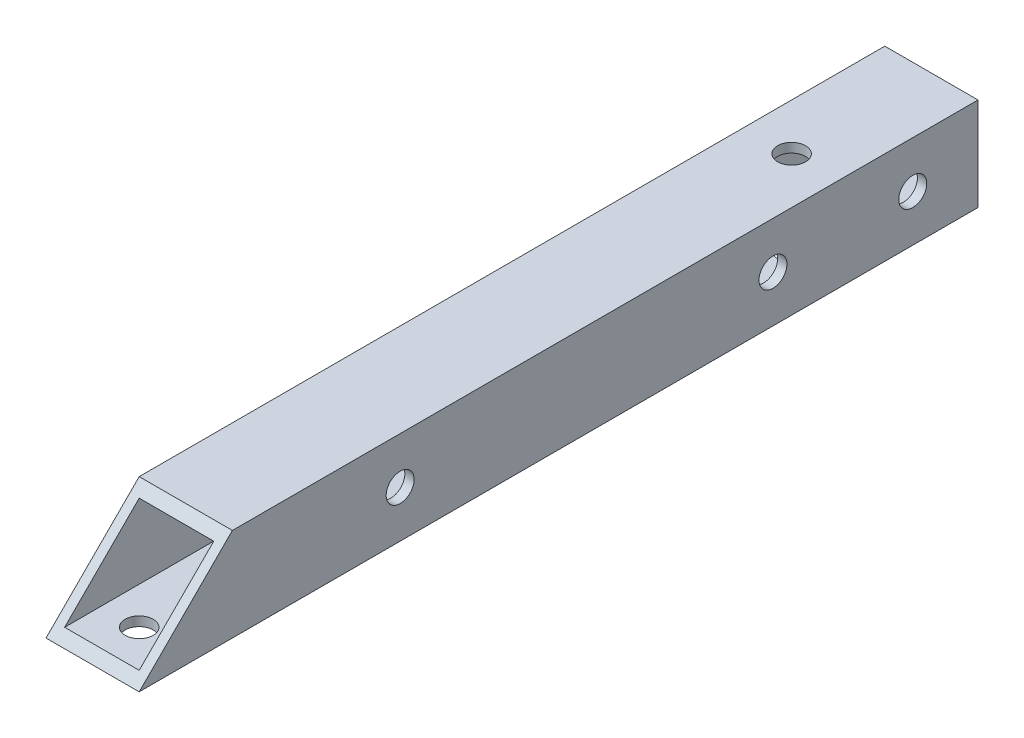
ISO-10303-21;
HEADER;
FILE_DESCRIPTION(('STEP AP214'),'2;1');
FILE_NAME('part.step','',(''),(''),'','','');
FILE_SCHEMA(('AUTOMOTIVE_DESIGN { 1 0 10303 214 1 1 1 1 }'));
ENDSEC;
DATA;
#1=APPLICATION_CONTEXT('core data for automotive mechanical design processes');
#2=APPLICATION_PROTOCOL_DEFINITION('international standard','automotive_design',2000,#1);
#3=PRODUCT_CONTEXT('',#1,'mechanical');
#4=PRODUCT('Part','Part','',(#3));
#5=PRODUCT_RELATED_PRODUCT_CATEGORY('part','',(#4));
#6=PRODUCT_DEFINITION_FORMATION('','',#4);
#7=PRODUCT_DEFINITION_CONTEXT('part definition',#1,'design');
#8=PRODUCT_DEFINITION('design','',#6,#7);
#9=PRODUCT_DEFINITION_SHAPE('','',#8);
#10=(LENGTH_UNIT() NAMED_UNIT(*) SI_UNIT(.MILLI.,.METRE.));
#11=(NAMED_UNIT(*) PLANE_ANGLE_UNIT() SI_UNIT($,.RADIAN.));
#12=(NAMED_UNIT(*) SI_UNIT($,.STERADIAN.) SOLID_ANGLE_UNIT());
#13=UNCERTAINTY_MEASURE_WITH_UNIT(LENGTH_MEASURE(1.E-05),#10,'distance_accuracy_value','');
#14=(GEOMETRIC_REPRESENTATION_CONTEXT(3) GLOBAL_UNCERTAINTY_ASSIGNED_CONTEXT((#13)) GLOBAL_UNIT_ASSIGNED_CONTEXT((#10,
#11,#12)) REPRESENTATION_CONTEXT('',''));
#15=CARTESIAN_POINT('',(0.,0.,0.));
#16=DIRECTION('',(0.,0.,1.));
#17=DIRECTION('',(1.,0.,0.));
#18=AXIS2_PLACEMENT_3D('',#15,#16,#17);
#19=CARTESIAN_POINT('',(0.,0.,0.));
#20=DIRECTION('',(0.,0.,1.));
#21=DIRECTION('',(1.,0.,0.));
#22=AXIS2_PLACEMENT_3D('',#19,#20,#21);
#23=PLANE('',#22);
#24=DIRECTION('',(0.,-1.,0.));
#25=VECTOR('',#24,1.);
#26=CARTESIAN_POINT('',(-5.,5.,0.));
#27=LINE('',#26,#25);
#28=CARTESIAN_POINT('',(-5.,5.,0.));
#29=VERTEX_POINT('',#28);
#30=CARTESIAN_POINT('',(-5.,-5.,0.));
#31=VERTEX_POINT('',#30);
#32=EDGE_CURVE('E231',#29,#31,#27,.T.);
#33=ORIENTED_EDGE('',*,*,#32,.F.);
#34=DIRECTION('',(-1.,0.,0.));
#35=VECTOR('',#34,1.);
#36=CARTESIAN_POINT('',(-5.,5.,0.));
#37=LINE('',#36,#35);
#38=CARTESIAN_POINT('',(4.99999999999999,5.,0.));
#39=VERTEX_POINT('',#38);
#40=EDGE_CURVE('E134',#39,#29,#37,.T.);
#41=ORIENTED_EDGE('',*,*,#40,.F.);
#42=DIRECTION('',(0.,1.,0.));
#43=VECTOR('',#42,1.);
#44=CARTESIAN_POINT('',(4.99999999999999,5.,0.));
#45=LINE('',#44,#43);
#46=CARTESIAN_POINT('',(4.99999999999999,-5.,0.));
#47=VERTEX_POINT('',#46);
#48=EDGE_CURVE('E236',#47,#39,#45,.T.);
#49=ORIENTED_EDGE('',*,*,#48,.F.);
#50=DIRECTION('',(1.,0.,0.));
#51=VECTOR('',#50,1.);
#52=CARTESIAN_POINT('',(-5.,-5.,0.));
#53=LINE('',#52,#51);
#54=EDGE_CURVE('E147',#31,#47,#53,.T.);
#55=ORIENTED_EDGE('',*,*,#54,.F.);
#56=EDGE_LOOP('',(#33,#41,#49,#55));
#57=FACE_BOUND('',#56,.T.);
#58=DIRECTION('',(0.,-1.,0.));
#59=VECTOR('',#58,1.);
#60=CARTESIAN_POINT('',(-4.,5.,0.));
#61=LINE('',#60,#59);
#62=CARTESIAN_POINT('',(-4.,4.,0.));
#63=VERTEX_POINT('',#62);
#64=CARTESIAN_POINT('',(-4.,-4.,0.));
#65=VERTEX_POINT('',#64);
#66=EDGE_CURVE('E212',#63,#65,#61,.T.);
#67=ORIENTED_EDGE('',*,*,#66,.T.);
#68=DIRECTION('',(1.,0.,0.));
#69=VECTOR('',#68,1.);
#70=CARTESIAN_POINT('',(-5.,-4.,0.));
#71=LINE('',#70,#69);
#72=CARTESIAN_POINT('',(3.99999999999999,-4.,0.));
#73=VERTEX_POINT('',#72);
#74=EDGE_CURVE('E215',#65,#73,#71,.T.);
#75=ORIENTED_EDGE('',*,*,#74,.T.);
#76=DIRECTION('',(0.,1.,0.));
#77=VECTOR('',#76,1.);
#78=CARTESIAN_POINT('',(3.99999999999999,5.,0.));
#79=LINE('',#78,#77);
#80=CARTESIAN_POINT('',(3.99999999999999,4.,0.));
#81=VERTEX_POINT('',#80);
#82=EDGE_CURVE('E218',#73,#81,#79,.T.);
#83=ORIENTED_EDGE('',*,*,#82,.T.);
#84=DIRECTION('',(-1.,0.,0.));
#85=VECTOR('',#84,1.);
#86=CARTESIAN_POINT('',(-5.,4.,0.));
#87=LINE('',#86,#85);
#88=EDGE_CURVE('E221',#81,#63,#87,.T.);
#89=ORIENTED_EDGE('',*,*,#88,.T.);
#90=EDGE_LOOP('',(#67,#75,#83,#89));
#91=FACE_BOUND('',#90,.T.);
#92=ADVANCED_FACE('F63',(#57,#91),#23,.F.);
#93=CARTESIAN_POINT('',(-5.,5.,90.));
#94=DIRECTION('',(1.,0.,0.));
#95=DIRECTION('',(0.,0.,-1.));
#96=AXIS2_PLACEMENT_3D('',#93,#94,#95);
#97=PLANE('',#96);
#98=CARTESIAN_POINT('',(-5.,0.,62.));
#99=DIRECTION('',(1.,0.,0.));
#100=DIRECTION('',(0.,0.,-1.));
#101=AXIS2_PLACEMENT_3D('',#98,#99,#100);
#102=CIRCLE('',#101,1.5);
#103=CARTESIAN_POINT('',(-5.,0.,60.5));
#104=VERTEX_POINT('',#103);
#105=EDGE_CURVE('E157',#104,#104,#102,.T.);
#106=ORIENTED_EDGE('',*,*,#105,.T.);
#107=EDGE_LOOP('',(#106));
#108=FACE_BOUND('',#107,.T.);
#109=CARTESIAN_POINT('',(-5.,0.,7.));
#110=DIRECTION('',(1.,0.,0.));
#111=DIRECTION('',(0.,0.,-1.));
#112=AXIS2_PLACEMENT_3D('',#109,#110,#111);
#113=CIRCLE('',#112,1.5);
#114=CARTESIAN_POINT('',(-5.,0.,5.5));
#115=VERTEX_POINT('',#114);
#116=EDGE_CURVE('E198',#115,#115,#113,.T.);
#117=ORIENTED_EDGE('',*,*,#116,.T.);
#118=EDGE_LOOP('',(#117));
#119=FACE_BOUND('',#118,.T.);
#120=CARTESIAN_POINT('',(-5.,0.,22.));
#121=DIRECTION('',(1.,0.,0.));
#122=DIRECTION('',(0.,0.,-1.));
#123=AXIS2_PLACEMENT_3D('',#120,#121,#122);
#124=CIRCLE('',#123,1.5);
#125=CARTESIAN_POINT('',(-5.,0.,20.5));
#126=VERTEX_POINT('',#125);
#127=EDGE_CURVE('E189',#126,#126,#124,.T.);
#128=ORIENTED_EDGE('',*,*,#127,.T.);
#129=EDGE_LOOP('',(#128));
#130=FACE_BOUND('',#129,.T.);
#131=DIRECTION('',(0.,0.,-1.));
#132=VECTOR('',#131,1.);
#133=CARTESIAN_POINT('',(-5.,-5.,90.));
#134=LINE('',#133,#132);
#135=CARTESIAN_POINT('',(-5.,-5.,90.));
#136=VERTEX_POINT('',#135);
#137=EDGE_CURVE('E71',#136,#31,#134,.T.);
#138=ORIENTED_EDGE('',*,*,#137,.F.);
#139=DIRECTION('',(0.,-0.707106781186551,0.707106781186544));
#140=VECTOR('',#139,1.);
#141=CARTESIAN_POINT('',(-5.,-5.,90.));
#142=LINE('',#141,#140);
#143=CARTESIAN_POINT('',(-5.,5.,80.0000000000001));
#144=VERTEX_POINT('',#143);
#145=EDGE_CURVE('E128',#144,#136,#142,.T.);
#146=ORIENTED_EDGE('',*,*,#145,.F.);
#147=DIRECTION('',(0.,0.,-1.));
#148=VECTOR('',#147,1.);
#149=CARTESIAN_POINT('',(-5.,5.,90.));
#150=LINE('',#149,#148);
#151=EDGE_CURVE('E133',#144,#29,#150,.T.);
#152=ORIENTED_EDGE('',*,*,#151,.T.);
#153=ORIENTED_EDGE('',*,*,#32,.T.);
#154=EDGE_LOOP('',(#138,#146,#152,#153));
#155=FACE_BOUND('',#154,.T.);
#156=ADVANCED_FACE('F65',(#108,#119,#130,#155),#97,.F.);
#157=CARTESIAN_POINT('',(-5.,-5.,90.));
#158=DIRECTION('',(0.,1.,0.));
#159=DIRECTION('',(0.,0.,1.));
#160=AXIS2_PLACEMENT_3D('',#157,#158,#159);
#161=PLANE('',#160);
#162=CARTESIAN_POINT('',(0.,-5.,85.));
#163=DIRECTION('',(0.,1.,0.));
#164=DIRECTION('',(0.,0.,1.));
#165=AXIS2_PLACEMENT_3D('',#162,#163,#164);
#166=CIRCLE('',#165,1.5);
#167=CARTESIAN_POINT('',(0.,-5.,86.5));
#168=VERTEX_POINT('',#167);
#169=EDGE_CURVE('E168',#168,#168,#166,.T.);
#170=ORIENTED_EDGE('',*,*,#169,.T.);
#171=EDGE_LOOP('',(#170));
#172=FACE_BOUND('',#171,.T.);
#173=CARTESIAN_POINT('',(0.,-5.,15.));
#174=DIRECTION('',(0.,1.,0.));
#175=DIRECTION('',(0.,0.,1.));
#176=AXIS2_PLACEMENT_3D('',#173,#174,#175);
#177=CIRCLE('',#176,1.5);
#178=CARTESIAN_POINT('',(0.,-5.,16.5));
#179=VERTEX_POINT('',#178);
#180=EDGE_CURVE('E180',#179,#179,#177,.T.);
#181=ORIENTED_EDGE('',*,*,#180,.T.);
#182=EDGE_LOOP('',(#181));
#183=FACE_BOUND('',#182,.T.);
#184=ORIENTED_EDGE('',*,*,#54,.T.);
#185=DIRECTION('',(0.,0.,-1.));
#186=VECTOR('',#185,1.);
#187=CARTESIAN_POINT('',(4.99999999999999,-5.,90.));
#188=LINE('',#187,#186);
#189=CARTESIAN_POINT('',(5.,-5.,90.));
#190=VERTEX_POINT('',#189);
#191=EDGE_CURVE('E141',#190,#47,#188,.T.);
#192=ORIENTED_EDGE('',*,*,#191,.F.);
#193=DIRECTION('',(1.,0.,0.));
#194=VECTOR('',#193,1.);
#195=CARTESIAN_POINT('',(-5.,-5.,90.));
#196=LINE('',#195,#194);
#197=EDGE_CURVE('E125',#136,#190,#196,.T.);
#198=ORIENTED_EDGE('',*,*,#197,.F.);
#199=ORIENTED_EDGE('',*,*,#137,.T.);
#200=EDGE_LOOP('',(#184,#192,#198,#199));
#201=FACE_BOUND('',#200,.T.);
#202=ADVANCED_FACE('F146',(#172,#183,#201),#161,.F.);
#203=CARTESIAN_POINT('',(4.99999999999999,5.,90.));
#204=DIRECTION('',(-1.,0.,0.));
#205=DIRECTION('',(0.,0.,1.));
#206=AXIS2_PLACEMENT_3D('',#203,#204,#205);
#207=PLANE('',#206);
#208=CARTESIAN_POINT('',(4.99999999999999,0.,62.));
#209=DIRECTION('',(1.,0.,0.));
#210=DIRECTION('',(0.,0.,-1.));
#211=AXIS2_PLACEMENT_3D('',#208,#209,#210);
#212=CIRCLE('',#211,1.5);
#213=CARTESIAN_POINT('',(4.99999999999999,0.,60.5));
#214=VERTEX_POINT('',#213);
#215=EDGE_CURVE('E192',#214,#214,#212,.T.);
#216=ORIENTED_EDGE('',*,*,#215,.F.);
#217=EDGE_LOOP('',(#216));
#218=FACE_BOUND('',#217,.T.);
#219=CARTESIAN_POINT('',(4.99999999999999,0.,7.));
#220=DIRECTION('',(1.,0.,0.));
#221=DIRECTION('',(0.,0.,-1.));
#222=AXIS2_PLACEMENT_3D('',#219,#220,#221);
#223=CIRCLE('',#222,1.5);
#224=CARTESIAN_POINT('',(4.99999999999999,0.,5.5));
#225=VERTEX_POINT('',#224);
#226=EDGE_CURVE('E195',#225,#225,#223,.T.);
#227=ORIENTED_EDGE('',*,*,#226,.F.);
#228=EDGE_LOOP('',(#227));
#229=FACE_BOUND('',#228,.T.);
#230=CARTESIAN_POINT('',(4.99999999999999,0.,22.));
#231=DIRECTION('',(1.,0.,0.));
#232=DIRECTION('',(0.,0.,-1.));
#233=AXIS2_PLACEMENT_3D('',#230,#231,#232);
#234=CIRCLE('',#233,1.5);
#235=CARTESIAN_POINT('',(4.99999999999999,0.,20.5));
#236=VERTEX_POINT('',#235);
#237=EDGE_CURVE('E201',#236,#236,#234,.T.);
#238=ORIENTED_EDGE('',*,*,#237,.F.);
#239=EDGE_LOOP('',(#238));
#240=FACE_BOUND('',#239,.T.);
#241=DIRECTION('',(0.,0.,-1.));
#242=VECTOR('',#241,1.);
#243=CARTESIAN_POINT('',(4.99999999999999,5.,90.));
#244=LINE('',#243,#242);
#245=CARTESIAN_POINT('',(4.99999999999999,5.,80.0000000000001));
#246=VERTEX_POINT('',#245);
#247=EDGE_CURVE('E143',#246,#39,#244,.T.);
#248=ORIENTED_EDGE('',*,*,#247,.F.);
#249=DIRECTION('',(0.,-0.707106781186551,0.707106781186544));
#250=VECTOR('',#249,1.);
#251=CARTESIAN_POINT('',(5.,-5.,90.));
#252=LINE('',#251,#250);
#253=EDGE_CURVE('E78',#246,#190,#252,.T.);
#254=ORIENTED_EDGE('',*,*,#253,.T.);
#255=ORIENTED_EDGE('',*,*,#191,.T.);
#256=ORIENTED_EDGE('',*,*,#48,.T.);
#257=EDGE_LOOP('',(#248,#254,#255,#256));
#258=FACE_BOUND('',#257,.T.);
#259=ADVANCED_FACE('F139',(#218,#229,#240,#258),#207,.F.);
#260=CARTESIAN_POINT('',(-5.,5.,90.));
#261=DIRECTION('',(0.,-1.,0.));
#262=DIRECTION('',(0.,0.,-1.));
#263=AXIS2_PLACEMENT_3D('',#260,#261,#262);
#264=PLANE('',#263);
#265=CARTESIAN_POINT('',(0.,5.,15.));
#266=DIRECTION('',(0.,1.,0.));
#267=DIRECTION('',(0.,0.,1.));
#268=AXIS2_PLACEMENT_3D('',#265,#266,#267);
#269=CIRCLE('',#268,1.5);
#270=CARTESIAN_POINT('',(0.,5.,16.5));
#271=VERTEX_POINT('',#270);
#272=EDGE_CURVE('E175',#271,#271,#269,.T.);
#273=ORIENTED_EDGE('',*,*,#272,.F.);
#274=EDGE_LOOP('',(#273));
#275=FACE_BOUND('',#274,.T.);
#276=ORIENTED_EDGE('',*,*,#151,.F.);
#277=DIRECTION('',(-1.,0.,0.));
#278=VECTOR('',#277,1.);
#279=CARTESIAN_POINT('',(5.,5.,80.0000000000001));
#280=LINE('',#279,#278);
#281=EDGE_CURVE('E144',#246,#144,#280,.T.);
#282=ORIENTED_EDGE('',*,*,#281,.F.);
#283=ORIENTED_EDGE('',*,*,#247,.T.);
#284=ORIENTED_EDGE('',*,*,#40,.T.);
#285=EDGE_LOOP('',(#276,#282,#283,#284));
#286=FACE_BOUND('',#285,.T.);
#287=ADVANCED_FACE('F244',(#275,#286),#264,.F.);
#288=CARTESIAN_POINT('',(-4.,5.,90.));
#289=DIRECTION('',(1.,0.,0.));
#290=DIRECTION('',(0.,0.,-1.));
#291=AXIS2_PLACEMENT_3D('',#288,#289,#290);
#292=PLANE('',#291);
#293=DIRECTION('',(0.,0.707106781186551,-0.707106781186544));
#294=VECTOR('',#293,1.);
#295=CARTESIAN_POINT('',(-4.,0.,85.));
#296=LINE('',#295,#294);
#297=CARTESIAN_POINT('',(-4.,-4.,89.));
#298=VERTEX_POINT('',#297);
#299=CARTESIAN_POINT('',(-4.,4.,81.0000000000001));
#300=VERTEX_POINT('',#299);
#301=EDGE_CURVE('E85',#298,#300,#296,.T.);
#302=ORIENTED_EDGE('',*,*,#301,.F.);
#303=DIRECTION('',(0.,0.,-1.));
#304=VECTOR('',#303,1.);
#305=CARTESIAN_POINT('',(-4.,-4.,90.));
#306=LINE('',#305,#304);
#307=EDGE_CURVE('E230',#298,#65,#306,.T.);
#308=ORIENTED_EDGE('',*,*,#307,.T.);
#309=ORIENTED_EDGE('',*,*,#66,.F.);
#310=DIRECTION('',(0.,0.,-1.));
#311=VECTOR('',#310,1.);
#312=CARTESIAN_POINT('',(-4.,4.,90.));
#313=LINE('',#312,#311);
#314=EDGE_CURVE('E224',#300,#63,#313,.T.);
#315=ORIENTED_EDGE('',*,*,#314,.F.);
#316=EDGE_LOOP('',(#302,#308,#309,#315));
#317=FACE_BOUND('',#316,.T.);
#318=CARTESIAN_POINT('',(-4.,0.,62.));
#319=DIRECTION('',(1.,0.,0.));
#320=DIRECTION('',(0.,0.,-1.));
#321=AXIS2_PLACEMENT_3D('',#318,#319,#320);
#322=CIRCLE('',#321,1.5);
#323=CARTESIAN_POINT('',(-4.,0.,60.5));
#324=VERTEX_POINT('',#323);
#325=EDGE_CURVE('E164',#324,#324,#322,.T.);
#326=ORIENTED_EDGE('',*,*,#325,.F.);
#327=EDGE_LOOP('',(#326));
#328=FACE_BOUND('',#327,.T.);
#329=CARTESIAN_POINT('',(-4.,0.,7.));
#330=DIRECTION('',(1.,0.,0.));
#331=DIRECTION('',(0.,0.,-1.));
#332=AXIS2_PLACEMENT_3D('',#329,#330,#331);
#333=CIRCLE('',#332,1.5);
#334=CARTESIAN_POINT('',(-4.,0.,5.5));
#335=VERTEX_POINT('',#334);
#336=EDGE_CURVE('E161',#335,#335,#333,.T.);
#337=ORIENTED_EDGE('',*,*,#336,.F.);
#338=EDGE_LOOP('',(#337));
#339=FACE_BOUND('',#338,.T.);
#340=CARTESIAN_POINT('',(-4.,0.,22.));
#341=DIRECTION('',(1.,0.,0.));
#342=DIRECTION('',(0.,0.,-1.));
#343=AXIS2_PLACEMENT_3D('',#340,#341,#342);
#344=CIRCLE('',#343,1.5);
#345=CARTESIAN_POINT('',(-4.,0.,20.5));
#346=VERTEX_POINT('',#345);
#347=EDGE_CURVE('E156',#346,#346,#344,.T.);
#348=ORIENTED_EDGE('',*,*,#347,.F.);
#349=EDGE_LOOP('',(#348));
#350=FACE_BOUND('',#349,.T.);
#351=ADVANCED_FACE('F254',(#317,#328,#339,#350),#292,.T.);
#352=CARTESIAN_POINT('',(-5.,-4.,90.));
#353=DIRECTION('',(0.,1.,0.));
#354=DIRECTION('',(0.,0.,1.));
#355=AXIS2_PLACEMENT_3D('',#352,#353,#354);
#356=PLANE('',#355);
#357=DIRECTION('',(-1.,0.,0.));
#358=VECTOR('',#357,1.);
#359=CARTESIAN_POINT('',(-5.,-4.,89.));
#360=LINE('',#359,#358);
#361=CARTESIAN_POINT('',(3.99999999999999,-4.,89.));
#362=VERTEX_POINT('',#361);
#363=EDGE_CURVE('E263',#362,#298,#360,.T.);
#364=ORIENTED_EDGE('',*,*,#363,.F.);
#365=DIRECTION('',(0.,0.,-1.));
#366=VECTOR('',#365,1.);
#367=CARTESIAN_POINT('',(3.99999999999999,-4.,90.));
#368=LINE('',#367,#366);
#369=EDGE_CURVE('E228',#362,#73,#368,.T.);
#370=ORIENTED_EDGE('',*,*,#369,.T.);
#371=ORIENTED_EDGE('',*,*,#74,.F.);
#372=ORIENTED_EDGE('',*,*,#307,.F.);
#373=EDGE_LOOP('',(#364,#370,#371,#372));
#374=FACE_BOUND('',#373,.T.);
#375=CARTESIAN_POINT('',(0.,-4.,85.));
#376=DIRECTION('',(0.,1.,0.));
#377=DIRECTION('',(0.,0.,1.));
#378=AXIS2_PLACEMENT_3D('',#375,#376,#377);
#379=CIRCLE('',#378,1.5);
#380=CARTESIAN_POINT('',(0.,-4.,86.5));
#381=VERTEX_POINT('',#380);
#382=EDGE_CURVE('E172',#381,#381,#379,.T.);
#383=ORIENTED_EDGE('',*,*,#382,.F.);
#384=EDGE_LOOP('',(#383));
#385=FACE_BOUND('',#384,.T.);
#386=CARTESIAN_POINT('',(0.,-4.,15.));
#387=DIRECTION('',(0.,1.,0.));
#388=DIRECTION('',(0.,0.,1.));
#389=AXIS2_PLACEMENT_3D('',#386,#387,#388);
#390=CIRCLE('',#389,1.5);
#391=CARTESIAN_POINT('',(0.,-4.,16.5));
#392=VERTEX_POINT('',#391);
#393=EDGE_CURVE('E167',#392,#392,#390,.T.);
#394=ORIENTED_EDGE('',*,*,#393,.F.);
#395=EDGE_LOOP('',(#394));
#396=FACE_BOUND('',#395,.T.);
#397=ADVANCED_FACE('F259',(#374,#385,#396),#356,.T.);
#398=CARTESIAN_POINT('',(3.99999999999999,5.,90.));
#399=DIRECTION('',(-1.,0.,0.));
#400=DIRECTION('',(0.,0.,1.));
#401=AXIS2_PLACEMENT_3D('',#398,#399,#400);
#402=PLANE('',#401);
#403=DIRECTION('',(0.,-0.707106781186551,0.707106781186544));
#404=VECTOR('',#403,1.);
#405=CARTESIAN_POINT('',(3.99999999999999,0.,85.));
#406=LINE('',#405,#404);
#407=CARTESIAN_POINT('',(3.99999999999999,4.,81.0000000000001));
#408=VERTEX_POINT('',#407);
#409=EDGE_CURVE('E269',#408,#362,#406,.T.);
#410=ORIENTED_EDGE('',*,*,#409,.F.);
#411=DIRECTION('',(0.,0.,-1.));
#412=VECTOR('',#411,1.);
#413=CARTESIAN_POINT('',(3.99999999999999,4.,90.));
#414=LINE('',#413,#412);
#415=EDGE_CURVE('E226',#408,#81,#414,.T.);
#416=ORIENTED_EDGE('',*,*,#415,.T.);
#417=ORIENTED_EDGE('',*,*,#82,.F.);
#418=ORIENTED_EDGE('',*,*,#369,.F.);
#419=EDGE_LOOP('',(#410,#416,#417,#418));
#420=FACE_BOUND('',#419,.T.);
#421=CARTESIAN_POINT('',(3.99999999999999,0.,62.));
#422=DIRECTION('',(-1.,0.,0.));
#423=DIRECTION('',(0.,0.,1.));
#424=AXIS2_PLACEMENT_3D('',#421,#422,#423);
#425=CIRCLE('',#424,1.5);
#426=CARTESIAN_POINT('',(3.99999999999999,0.,63.5));
#427=VERTEX_POINT('',#426);
#428=EDGE_CURVE('E162',#427,#427,#425,.T.);
#429=ORIENTED_EDGE('',*,*,#428,.F.);
#430=EDGE_LOOP('',(#429));
#431=FACE_BOUND('',#430,.T.);
#432=CARTESIAN_POINT('',(3.99999999999999,0.,7.));
#433=DIRECTION('',(-1.,0.,0.));
#434=DIRECTION('',(0.,0.,1.));
#435=AXIS2_PLACEMENT_3D('',#432,#433,#434);
#436=CIRCLE('',#435,1.5);
#437=CARTESIAN_POINT('',(3.99999999999999,0.,8.5));
#438=VERTEX_POINT('',#437);
#439=EDGE_CURVE('E158',#438,#438,#436,.T.);
#440=ORIENTED_EDGE('',*,*,#439,.F.);
#441=EDGE_LOOP('',(#440));
#442=FACE_BOUND('',#441,.T.);
#443=CARTESIAN_POINT('',(3.99999999999999,0.,22.));
#444=DIRECTION('',(-1.,0.,0.));
#445=DIRECTION('',(0.,0.,1.));
#446=AXIS2_PLACEMENT_3D('',#443,#444,#445);
#447=CIRCLE('',#446,1.5);
#448=CARTESIAN_POINT('',(3.99999999999999,0.,23.5));
#449=VERTEX_POINT('',#448);
#450=EDGE_CURVE('E153',#449,#449,#447,.T.);
#451=ORIENTED_EDGE('',*,*,#450,.F.);
#452=EDGE_LOOP('',(#451));
#453=FACE_BOUND('',#452,.T.);
#454=ADVANCED_FACE('F266',(#420,#431,#442,#453),#402,.T.);
#455=CARTESIAN_POINT('',(-5.,4.,90.));
#456=DIRECTION('',(0.,-1.,0.));
#457=DIRECTION('',(0.,0.,-1.));
#458=AXIS2_PLACEMENT_3D('',#455,#456,#457);
#459=PLANE('',#458);
#460=DIRECTION('',(1.,0.,0.));
#461=VECTOR('',#460,1.);
#462=CARTESIAN_POINT('',(-5.,4.,81.0000000000001));
#463=LINE('',#462,#461);
#464=EDGE_CURVE('E12',#300,#408,#463,.T.);
#465=ORIENTED_EDGE('',*,*,#464,.F.);
#466=ORIENTED_EDGE('',*,*,#314,.T.);
#467=ORIENTED_EDGE('',*,*,#88,.F.);
#468=ORIENTED_EDGE('',*,*,#415,.F.);
#469=EDGE_LOOP('',(#465,#466,#467,#468));
#470=FACE_BOUND('',#469,.T.);
#471=CARTESIAN_POINT('',(0.,4.,15.));
#472=DIRECTION('',(0.,-1.,0.));
#473=DIRECTION('',(0.,0.,-1.));
#474=AXIS2_PLACEMENT_3D('',#471,#472,#473);
#475=CIRCLE('',#474,1.5);
#476=CARTESIAN_POINT('',(0.,4.,13.5));
#477=VERTEX_POINT('',#476);
#478=EDGE_CURVE('E165',#477,#477,#475,.T.);
#479=ORIENTED_EDGE('',*,*,#478,.F.);
#480=EDGE_LOOP('',(#479));
#481=FACE_BOUND('',#480,.T.);
#482=ADVANCED_FACE('F271',(#470,#481),#459,.T.);
#483=CARTESIAN_POINT('',(-5.,0.,22.));
#484=DIRECTION('',(1.,0.,0.));
#485=DIRECTION('',(0.,0.,-1.));
#486=AXIS2_PLACEMENT_3D('',#483,#484,#485);
#487=CYLINDRICAL_SURFACE('',#486,1.5);
#488=ORIENTED_EDGE('',*,*,#450,.T.);
#489=EDGE_LOOP('',(#488));
#490=FACE_BOUND('',#489,.T.);
#491=ORIENTED_EDGE('',*,*,#237,.T.);
#492=EDGE_LOOP('',(#491));
#493=FACE_BOUND('',#492,.T.);
#494=ADVANCED_FACE('F298',(#490,#493),#487,.F.);
#495=CARTESIAN_POINT('',(-5.,0.,7.));
#496=DIRECTION('',(1.,0.,0.));
#497=DIRECTION('',(0.,0.,-1.));
#498=AXIS2_PLACEMENT_3D('',#495,#496,#497);
#499=CYLINDRICAL_SURFACE('',#498,1.5);
#500=ORIENTED_EDGE('',*,*,#439,.T.);
#501=EDGE_LOOP('',(#500));
#502=FACE_BOUND('',#501,.T.);
#503=ORIENTED_EDGE('',*,*,#226,.T.);
#504=EDGE_LOOP('',(#503));
#505=FACE_BOUND('',#504,.T.);
#506=ADVANCED_FACE('F294',(#502,#505),#499,.F.);
#507=CARTESIAN_POINT('',(-5.,0.,62.));
#508=DIRECTION('',(1.,0.,0.));
#509=DIRECTION('',(0.,0.,-1.));
#510=AXIS2_PLACEMENT_3D('',#507,#508,#509);
#511=CYLINDRICAL_SURFACE('',#510,1.5);
#512=ORIENTED_EDGE('',*,*,#428,.T.);
#513=EDGE_LOOP('',(#512));
#514=FACE_BOUND('',#513,.T.);
#515=ORIENTED_EDGE('',*,*,#215,.T.);
#516=EDGE_LOOP('',(#515));
#517=FACE_BOUND('',#516,.T.);
#518=ADVANCED_FACE('F290',(#514,#517),#511,.F.);
#519=ORIENTED_EDGE('',*,*,#347,.T.);
#520=EDGE_LOOP('',(#519));
#521=FACE_BOUND('',#520,.T.);
#522=ORIENTED_EDGE('',*,*,#127,.F.);
#523=EDGE_LOOP('',(#522));
#524=FACE_BOUND('',#523,.T.);
#525=ADVANCED_FACE('F293',(#521,#524),#487,.F.);
#526=ORIENTED_EDGE('',*,*,#336,.T.);
#527=EDGE_LOOP('',(#526));
#528=FACE_BOUND('',#527,.T.);
#529=ORIENTED_EDGE('',*,*,#116,.F.);
#530=EDGE_LOOP('',(#529));
#531=FACE_BOUND('',#530,.T.);
#532=ADVANCED_FACE('F300',(#528,#531),#499,.F.);
#533=ORIENTED_EDGE('',*,*,#325,.T.);
#534=EDGE_LOOP('',(#533));
#535=FACE_BOUND('',#534,.T.);
#536=ORIENTED_EDGE('',*,*,#105,.F.);
#537=EDGE_LOOP('',(#536));
#538=FACE_BOUND('',#537,.T.);
#539=ADVANCED_FACE('F289',(#535,#538),#511,.F.);
#540=CARTESIAN_POINT('',(0.,-5.,15.));
#541=DIRECTION('',(0.,1.,0.));
#542=DIRECTION('',(0.,0.,1.));
#543=AXIS2_PLACEMENT_3D('',#540,#541,#542);
#544=CYLINDRICAL_SURFACE('',#543,1.5);
#545=ORIENTED_EDGE('',*,*,#478,.T.);
#546=EDGE_LOOP('',(#545));
#547=FACE_BOUND('',#546,.T.);
#548=ORIENTED_EDGE('',*,*,#272,.T.);
#549=EDGE_LOOP('',(#548));
#550=FACE_BOUND('',#549,.T.);
#551=ADVANCED_FACE('F286',(#547,#550),#544,.F.);
#552=ORIENTED_EDGE('',*,*,#393,.T.);
#553=EDGE_LOOP('',(#552));
#554=FACE_BOUND('',#553,.T.);
#555=ORIENTED_EDGE('',*,*,#180,.F.);
#556=EDGE_LOOP('',(#555));
#557=FACE_BOUND('',#556,.T.);
#558=ADVANCED_FACE('F282',(#554,#557),#544,.F.);
#559=CARTESIAN_POINT('',(0.,-5.,85.));
#560=DIRECTION('',(0.,1.,0.));
#561=DIRECTION('',(0.,0.,1.));
#562=AXIS2_PLACEMENT_3D('',#559,#560,#561);
#563=CYLINDRICAL_SURFACE('',#562,1.5);
#564=ORIENTED_EDGE('',*,*,#382,.T.);
#565=EDGE_LOOP('',(#564));
#566=FACE_BOUND('',#565,.T.);
#567=ORIENTED_EDGE('',*,*,#169,.F.);
#568=EDGE_LOOP('',(#567));
#569=FACE_BOUND('',#568,.T.);
#570=ADVANCED_FACE('F277',(#566,#569),#563,.F.);
#571=CARTESIAN_POINT('',(5.,-5.,90.));
#572=DIRECTION('',(0.,-0.707106781186544,-0.707106781186551));
#573=DIRECTION('',(0.,0.707106781186551,-0.707106781186544));
#574=AXIS2_PLACEMENT_3D('',#571,#572,#573);
#575=PLANE('',#574);
#576=ORIENTED_EDGE('',*,*,#301,.T.);
#577=ORIENTED_EDGE('',*,*,#464,.T.);
#578=ORIENTED_EDGE('',*,*,#409,.T.);
#579=ORIENTED_EDGE('',*,*,#363,.T.);
#580=EDGE_LOOP('',(#576,#577,#578,#579));
#581=FACE_BOUND('',#580,.T.);
#582=ORIENTED_EDGE('',*,*,#145,.T.);
#583=ORIENTED_EDGE('',*,*,#197,.T.);
#584=ORIENTED_EDGE('',*,*,#253,.F.);
#585=ORIENTED_EDGE('',*,*,#281,.T.);
#586=EDGE_LOOP('',(#582,#583,#584,#585));
#587=FACE_BOUND('',#586,.T.);
#588=ADVANCED_FACE('F126',(#581,#587),#575,.F.);
#589=CLOSED_SHELL('',(#92,#156,#202,#259,#287,#351,#397,#454,#482,#494,#506,#518,#525,#532,#539,
#551,#558,#570,#588));
#590=MANIFOLD_SOLID_BREP('B2',#589);
#591=ADVANCED_BREP_SHAPE_REPRESENTATION('',(#18,#590),#14);
#592=SHAPE_DEFINITION_REPRESENTATION(#9,#591);
ENDSEC;
END-ISO-10303-21;
